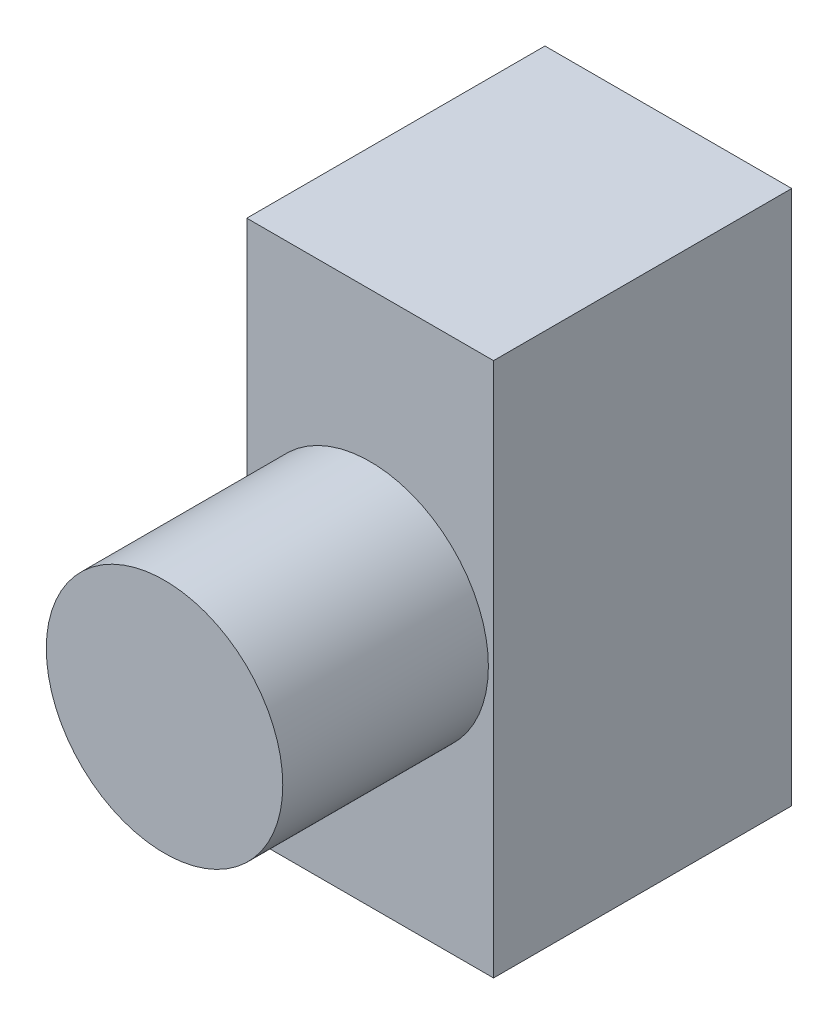
ISO-10303-21;
HEADER;
FILE_DESCRIPTION(('STEP AP214'),'2;1');
FILE_NAME('part.step','',(''),(''),'','','');
FILE_SCHEMA(('AUTOMOTIVE_DESIGN { 1 0 10303 214 1 1 1 1 }'));
ENDSEC;
DATA;
#1=APPLICATION_CONTEXT('core data for automotive mechanical design processes');
#2=APPLICATION_PROTOCOL_DEFINITION('international standard','automotive_design',2000,#1);
#3=PRODUCT_CONTEXT('',#1,'mechanical');
#4=PRODUCT('Part','Part','',(#3));
#5=PRODUCT_RELATED_PRODUCT_CATEGORY('part','',(#4));
#6=PRODUCT_DEFINITION_FORMATION('','',#4);
#7=PRODUCT_DEFINITION_CONTEXT('part definition',#1,'design');
#8=PRODUCT_DEFINITION('design','',#6,#7);
#9=PRODUCT_DEFINITION_SHAPE('','',#8);
#10=(LENGTH_UNIT() NAMED_UNIT(*) SI_UNIT(.MILLI.,.METRE.));
#11=(NAMED_UNIT(*) PLANE_ANGLE_UNIT() SI_UNIT($,.RADIAN.));
#12=(NAMED_UNIT(*) SI_UNIT($,.STERADIAN.) SOLID_ANGLE_UNIT());
#13=UNCERTAINTY_MEASURE_WITH_UNIT(LENGTH_MEASURE(1.E-05),#10,'distance_accuracy_value','');
#14=(GEOMETRIC_REPRESENTATION_CONTEXT(3) GLOBAL_UNCERTAINTY_ASSIGNED_CONTEXT((#13)) GLOBAL_UNIT_ASSIGNED_CONTEXT((#10,
#11,#12)) REPRESENTATION_CONTEXT('',''));
#15=CARTESIAN_POINT('',(0.,0.,0.));
#16=DIRECTION('',(0.,0.,1.));
#17=DIRECTION('',(1.,0.,0.));
#18=AXIS2_PLACEMENT_3D('',#15,#16,#17);
#19=CARTESIAN_POINT('',(-6.,13.,-14.5));
#20=DIRECTION('',(0.,-1.,0.));
#21=DIRECTION('',(1.,0.,0.));
#22=AXIS2_PLACEMENT_3D('',#19,#20,#21);
#23=PLANE('',#22);
#24=DIRECTION('',(1.,0.,0.));
#25=VECTOR('',#24,1.);
#26=CARTESIAN_POINT('',(-6.,13.,0.));
#27=LINE('',#26,#25);
#28=CARTESIAN_POINT('',(-6.,13.,0.));
#29=VERTEX_POINT('',#28);
#30=CARTESIAN_POINT('',(6.,13.,0.));
#31=VERTEX_POINT('',#30);
#32=EDGE_CURVE('E111',#29,#31,#27,.T.);
#33=ORIENTED_EDGE('',*,*,#32,.T.);
#34=DIRECTION('',(0.,0.,1.));
#35=VECTOR('',#34,1.);
#36=CARTESIAN_POINT('',(6.,13.,-14.5));
#37=LINE('',#36,#35);
#38=CARTESIAN_POINT('',(6.,13.,-14.5));
#39=VERTEX_POINT('',#38);
#40=EDGE_CURVE('E43',#39,#31,#37,.T.);
#41=ORIENTED_EDGE('',*,*,#40,.F.);
#42=DIRECTION('',(1.,0.,0.));
#43=VECTOR('',#42,1.);
#44=CARTESIAN_POINT('',(-6.,13.,-14.5));
#45=LINE('',#44,#43);
#46=CARTESIAN_POINT('',(-6.,13.,-14.5));
#47=VERTEX_POINT('',#46);
#48=EDGE_CURVE('E92',#47,#39,#45,.T.);
#49=ORIENTED_EDGE('',*,*,#48,.F.);
#50=DIRECTION('',(0.,0.,1.));
#51=VECTOR('',#50,1.);
#52=CARTESIAN_POINT('',(-6.,13.,-14.5));
#53=LINE('',#52,#51);
#54=EDGE_CURVE('E58',#47,#29,#53,.T.);
#55=ORIENTED_EDGE('',*,*,#54,.T.);
#56=EDGE_LOOP('',(#33,#41,#49,#55));
#57=FACE_BOUND('',#56,.T.);
#58=ADVANCED_FACE('F40',(#57),#23,.F.);
#59=CARTESIAN_POINT('',(6.,13.,-14.5));
#60=DIRECTION('',(-1.,0.,0.));
#61=DIRECTION('',(0.,0.,1.));
#62=AXIS2_PLACEMENT_3D('',#59,#60,#61);
#63=PLANE('',#62);
#64=DIRECTION('',(0.,-1.,0.));
#65=VECTOR('',#64,1.);
#66=CARTESIAN_POINT('',(6.,13.,0.));
#67=LINE('',#66,#65);
#68=CARTESIAN_POINT('',(6.,-13.,0.));
#69=VERTEX_POINT('',#68);
#70=EDGE_CURVE('E99',#31,#69,#67,.T.);
#71=ORIENTED_EDGE('',*,*,#70,.T.);
#72=DIRECTION('',(0.,0.,1.));
#73=VECTOR('',#72,1.);
#74=CARTESIAN_POINT('',(6.,-13.,-14.5));
#75=LINE('',#74,#73);
#76=CARTESIAN_POINT('',(6.,-13.,-14.5));
#77=VERTEX_POINT('',#76);
#78=EDGE_CURVE('E97',#77,#69,#75,.T.);
#79=ORIENTED_EDGE('',*,*,#78,.F.);
#80=DIRECTION('',(0.,-1.,0.));
#81=VECTOR('',#80,1.);
#82=CARTESIAN_POINT('',(6.,13.,-14.5));
#83=LINE('',#82,#81);
#84=EDGE_CURVE('E84',#39,#77,#83,.T.);
#85=ORIENTED_EDGE('',*,*,#84,.F.);
#86=ORIENTED_EDGE('',*,*,#40,.T.);
#87=EDGE_LOOP('',(#71,#79,#85,#86));
#88=FACE_BOUND('',#87,.T.);
#89=ADVANCED_FACE('F98',(#88),#63,.F.);
#90=CARTESIAN_POINT('',(-6.,-13.,-14.5));
#91=DIRECTION('',(0.,-1.,0.));
#92=DIRECTION('',(0.,0.,-1.));
#93=AXIS2_PLACEMENT_3D('',#90,#91,#92);
#94=PLANE('',#93);
#95=DIRECTION('',(1.,0.,0.));
#96=VECTOR('',#95,1.);
#97=CARTESIAN_POINT('',(-6.,-13.,0.));
#98=LINE('',#97,#96);
#99=CARTESIAN_POINT('',(-6.,-13.,0.));
#100=VERTEX_POINT('',#99);
#101=EDGE_CURVE('E117',#100,#69,#98,.T.);
#102=ORIENTED_EDGE('',*,*,#101,.F.);
#103=DIRECTION('',(0.,0.,1.));
#104=VECTOR('',#103,1.);
#105=CARTESIAN_POINT('',(-6.,-13.,-14.5));
#106=LINE('',#105,#104);
#107=CARTESIAN_POINT('',(-6.,-13.,-14.5));
#108=VERTEX_POINT('',#107);
#109=EDGE_CURVE('E72',#108,#100,#106,.T.);
#110=ORIENTED_EDGE('',*,*,#109,.F.);
#111=DIRECTION('',(1.,0.,0.));
#112=VECTOR('',#111,1.);
#113=CARTESIAN_POINT('',(-6.,-13.,-14.5));
#114=LINE('',#113,#112);
#115=EDGE_CURVE('E91',#108,#77,#114,.T.);
#116=ORIENTED_EDGE('',*,*,#115,.T.);
#117=ORIENTED_EDGE('',*,*,#78,.T.);
#118=EDGE_LOOP('',(#102,#110,#116,#117));
#119=FACE_BOUND('',#118,.T.);
#120=ADVANCED_FACE('F103',(#119),#94,.T.);
#121=CARTESIAN_POINT('',(-6.,13.,-14.5));
#122=DIRECTION('',(-1.,0.,0.));
#123=DIRECTION('',(0.,-1.,0.));
#124=AXIS2_PLACEMENT_3D('',#121,#122,#123);
#125=PLANE('',#124);
#126=DIRECTION('',(0.,-1.,0.));
#127=VECTOR('',#126,1.);
#128=CARTESIAN_POINT('',(-6.,13.,0.));
#129=LINE('',#128,#127);
#130=EDGE_CURVE('E120',#29,#100,#129,.T.);
#131=ORIENTED_EDGE('',*,*,#130,.F.);
#132=ORIENTED_EDGE('',*,*,#54,.F.);
#133=DIRECTION('',(0.,-1.,0.));
#134=VECTOR('',#133,1.);
#135=CARTESIAN_POINT('',(-6.,13.,-14.5));
#136=LINE('',#135,#134);
#137=EDGE_CURVE('E105',#47,#108,#136,.T.);
#138=ORIENTED_EDGE('',*,*,#137,.T.);
#139=ORIENTED_EDGE('',*,*,#109,.T.);
#140=EDGE_LOOP('',(#131,#132,#138,#139));
#141=FACE_BOUND('',#140,.T.);
#142=ADVANCED_FACE('F130',(#141),#125,.T.);
#143=CARTESIAN_POINT('',(0.,0.,-14.5));
#144=DIRECTION('',(0.,0.,-1.));
#145=DIRECTION('',(-1.,0.,0.));
#146=AXIS2_PLACEMENT_3D('',#143,#144,#145);
#147=PLANE('',#146);
#148=ORIENTED_EDGE('',*,*,#48,.T.);
#149=ORIENTED_EDGE('',*,*,#84,.T.);
#150=ORIENTED_EDGE('',*,*,#115,.F.);
#151=ORIENTED_EDGE('',*,*,#137,.F.);
#152=EDGE_LOOP('',(#148,#149,#150,#151));
#153=FACE_BOUND('',#152,.T.);
#154=ADVANCED_FACE('F88',(#153),#147,.T.);
#155=CARTESIAN_POINT('',(0.,0.,0.));
#156=DIRECTION('',(0.,0.,-1.));
#157=DIRECTION('',(-1.,0.,0.));
#158=AXIS2_PLACEMENT_3D('',#155,#156,#157);
#159=PLANE('',#158);
#160=CARTESIAN_POINT('',(0.,0.,0.));
#161=DIRECTION('',(0.,0.,1.));
#162=DIRECTION('',(1.,0.,0.));
#163=AXIS2_PLACEMENT_3D('',#160,#161,#162);
#164=CIRCLE('',#163,5.75);
#165=CARTESIAN_POINT('',(5.75,0.,0.));
#166=VERTEX_POINT('',#165);
#167=EDGE_CURVE('E11',#166,#166,#164,.T.);
#168=ORIENTED_EDGE('',*,*,#167,.F.);
#169=EDGE_LOOP('',(#168));
#170=FACE_BOUND('',#169,.T.);
#171=ORIENTED_EDGE('',*,*,#32,.F.);
#172=ORIENTED_EDGE('',*,*,#130,.T.);
#173=ORIENTED_EDGE('',*,*,#101,.T.);
#174=ORIENTED_EDGE('',*,*,#70,.F.);
#175=EDGE_LOOP('',(#171,#172,#173,#174));
#176=FACE_BOUND('',#175,.T.);
#177=ADVANCED_FACE('F129',(#170,#176),#159,.F.);
#178=CARTESIAN_POINT('',(0.,0.,10.));
#179=DIRECTION('',(0.,0.,-1.));
#180=DIRECTION('',(-1.,0.,0.));
#181=AXIS2_PLACEMENT_3D('',#178,#179,#180);
#182=CYLINDRICAL_SURFACE('',#181,5.75);
#183=CARTESIAN_POINT('',(0.,0.,10.));
#184=DIRECTION('',(0.,0.,1.));
#185=DIRECTION('',(1.,0.,0.));
#186=AXIS2_PLACEMENT_3D('',#183,#184,#185);
#187=CIRCLE('',#186,5.75);
#188=CARTESIAN_POINT('',(5.75,0.,10.));
#189=VERTEX_POINT('',#188);
#190=EDGE_CURVE('E114',#189,#189,#187,.T.);
#191=ORIENTED_EDGE('',*,*,#190,.F.);
#192=EDGE_LOOP('',(#191));
#193=FACE_BOUND('',#192,.T.);
#194=ORIENTED_EDGE('',*,*,#167,.T.);
#195=EDGE_LOOP('',(#194));
#196=FACE_BOUND('',#195,.T.);
#197=ADVANCED_FACE('F169',(#193,#196),#182,.T.);
#198=CARTESIAN_POINT('',(0.,0.,10.));
#199=DIRECTION('',(0.,0.,1.));
#200=DIRECTION('',(1.,0.,0.));
#201=AXIS2_PLACEMENT_3D('',#198,#199,#200);
#202=PLANE('',#201);
#203=ORIENTED_EDGE('',*,*,#190,.T.);
#204=EDGE_LOOP('',(#203));
#205=FACE_BOUND('',#204,.T.);
#206=ADVANCED_FACE('F178',(#205),#202,.T.);
#207=CLOSED_SHELL('',(#58,#89,#120,#142,#154,#177,#197,#206));
#208=MANIFOLD_SOLID_BREP('B2',#207);
#209=ADVANCED_BREP_SHAPE_REPRESENTATION('',(#18,#208),#14);
#210=SHAPE_DEFINITION_REPRESENTATION(#9,#209);
ENDSEC;
END-ISO-10303-21;
